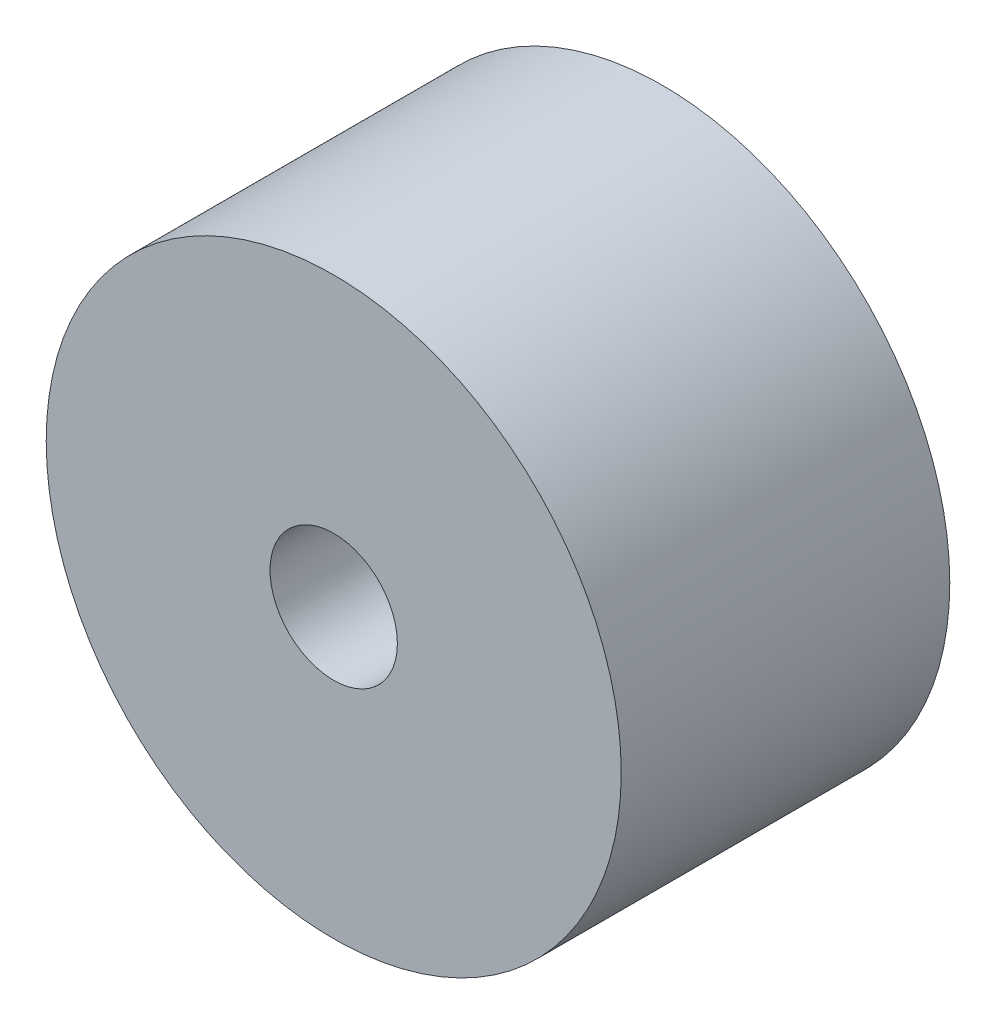
ISO-10303-21;
HEADER;
FILE_DESCRIPTION(('STEP AP214'),'2;1');
FILE_NAME('part.step','',(''),(''),'','','');
FILE_SCHEMA(('AUTOMOTIVE_DESIGN { 1 0 10303 214 1 1 1 1 }'));
ENDSEC;
DATA;
#1=APPLICATION_CONTEXT('core data for automotive mechanical design processes');
#2=APPLICATION_PROTOCOL_DEFINITION('international standard','automotive_design',2000,#1);
#3=PRODUCT_CONTEXT('',#1,'mechanical');
#4=PRODUCT('Part','Part','',(#3));
#5=PRODUCT_RELATED_PRODUCT_CATEGORY('part','',(#4));
#6=PRODUCT_DEFINITION_FORMATION('','',#4);
#7=PRODUCT_DEFINITION_CONTEXT('part definition',#1,'design');
#8=PRODUCT_DEFINITION('design','',#6,#7);
#9=PRODUCT_DEFINITION_SHAPE('','',#8);
#10=(LENGTH_UNIT() NAMED_UNIT(*) SI_UNIT(.MILLI.,.METRE.));
#11=(NAMED_UNIT(*) PLANE_ANGLE_UNIT() SI_UNIT($,.RADIAN.));
#12=(NAMED_UNIT(*) SI_UNIT($,.STERADIAN.) SOLID_ANGLE_UNIT());
#13=UNCERTAINTY_MEASURE_WITH_UNIT(LENGTH_MEASURE(1.E-05),#10,'distance_accuracy_value','');
#14=(GEOMETRIC_REPRESENTATION_CONTEXT(3) GLOBAL_UNCERTAINTY_ASSIGNED_CONTEXT((#13)) GLOBAL_UNIT_ASSIGNED_CONTEXT((#10,
#11,#12)) REPRESENTATION_CONTEXT('',''));
#15=CARTESIAN_POINT('',(0.,0.,0.));
#16=DIRECTION('',(0.,0.,1.));
#17=DIRECTION('',(1.,0.,0.));
#18=AXIS2_PLACEMENT_3D('',#15,#16,#17);
#19=CARTESIAN_POINT('',(0.,0.,8.));
#20=DIRECTION('',(0.,0.,-1.));
#21=DIRECTION('',(-1.,0.,0.));
#22=AXIS2_PLACEMENT_3D('',#19,#20,#21);
#23=CYLINDRICAL_SURFACE('',#22,7.);
#24=CARTESIAN_POINT('',(0.,0.,8.));
#25=DIRECTION('',(0.,0.,1.));
#26=DIRECTION('',(1.,0.,0.));
#27=AXIS2_PLACEMENT_3D('',#24,#25,#26);
#28=CIRCLE('',#27,7.);
#29=CARTESIAN_POINT('',(7.,0.,8.));
#30=VERTEX_POINT('',#29);
#31=EDGE_CURVE('E10',#30,#30,#28,.T.);
#32=ORIENTED_EDGE('',*,*,#31,.F.);
#33=EDGE_LOOP('',(#32));
#34=FACE_BOUND('',#33,.T.);
#35=CARTESIAN_POINT('',(0.,0.,0.));
#36=DIRECTION('',(0.,0.,1.));
#37=DIRECTION('',(1.,0.,0.));
#38=AXIS2_PLACEMENT_3D('',#35,#36,#37);
#39=CIRCLE('',#38,7.);
#40=CARTESIAN_POINT('',(7.,0.,0.));
#41=VERTEX_POINT('',#40);
#42=EDGE_CURVE('E35',#41,#41,#39,.T.);
#43=ORIENTED_EDGE('',*,*,#42,.T.);
#44=EDGE_LOOP('',(#43));
#45=FACE_BOUND('',#44,.T.);
#46=ADVANCED_FACE('F32',(#34,#45),#23,.T.);
#47=CARTESIAN_POINT('',(0.,0.,8.));
#48=DIRECTION('',(0.,0.,1.));
#49=DIRECTION('',(1.,0.,0.));
#50=AXIS2_PLACEMENT_3D('',#47,#48,#49);
#51=PLANE('',#50);
#52=CARTESIAN_POINT('',(0.,0.,8.));
#53=DIRECTION('',(0.,0.,1.));
#54=DIRECTION('',(1.,0.,0.));
#55=AXIS2_PLACEMENT_3D('',#52,#53,#54);
#56=CIRCLE('',#55,1.55);
#57=CARTESIAN_POINT('',(1.55,0.,8.));
#58=VERTEX_POINT('',#57);
#59=EDGE_CURVE('E44',#58,#58,#56,.T.);
#60=ORIENTED_EDGE('',*,*,#59,.F.);
#61=EDGE_LOOP('',(#60));
#62=FACE_BOUND('',#61,.T.);
#63=ORIENTED_EDGE('',*,*,#31,.T.);
#64=EDGE_LOOP('',(#63));
#65=FACE_BOUND('',#64,.T.);
#66=ADVANCED_FACE('F59',(#62,#65),#51,.T.);
#67=CARTESIAN_POINT('',(0.,0.,0.));
#68=DIRECTION('',(0.,0.,1.));
#69=DIRECTION('',(1.,0.,0.));
#70=AXIS2_PLACEMENT_3D('',#67,#68,#69);
#71=PLANE('',#70);
#72=ORIENTED_EDGE('',*,*,#42,.F.);
#73=EDGE_LOOP('',(#72));
#74=FACE_BOUND('',#73,.T.);
#75=ADVANCED_FACE('F55',(#74),#71,.F.);
#76=CARTESIAN_POINT('',(0.,0.,5.));
#77=DIRECTION('',(0.,0.,1.));
#78=DIRECTION('',(1.,0.,0.));
#79=AXIS2_PLACEMENT_3D('',#76,#77,#78);
#80=CYLINDRICAL_SURFACE('',#79,1.55);
#81=CARTESIAN_POINT('',(0.,0.,5.));
#82=DIRECTION('',(0.,0.,1.));
#83=DIRECTION('',(1.,0.,0.));
#84=AXIS2_PLACEMENT_3D('',#81,#82,#83);
#85=CIRCLE('',#84,1.55);
#86=CARTESIAN_POINT('',(1.55,0.,5.));
#87=VERTEX_POINT('',#86);
#88=EDGE_CURVE('E42',#87,#87,#85,.T.);
#89=ORIENTED_EDGE('',*,*,#88,.F.);
#90=EDGE_LOOP('',(#89));
#91=FACE_BOUND('',#90,.T.);
#92=ORIENTED_EDGE('',*,*,#59,.T.);
#93=EDGE_LOOP('',(#92));
#94=FACE_BOUND('',#93,.T.);
#95=ADVANCED_FACE('F52',(#91,#94),#80,.F.);
#96=CARTESIAN_POINT('',(0.,0.,5.));
#97=DIRECTION('',(0.,0.,1.));
#98=DIRECTION('',(1.,0.,0.));
#99=AXIS2_PLACEMENT_3D('',#96,#97,#98);
#100=PLANE('',#99);
#101=ORIENTED_EDGE('',*,*,#88,.T.);
#102=EDGE_LOOP('',(#101));
#103=FACE_BOUND('',#102,.T.);
#104=ADVANCED_FACE('F50',(#103),#100,.T.);
#105=CLOSED_SHELL('',(#46,#66,#75,#95,#104));
#106=MANIFOLD_SOLID_BREP('B2',#105);
#107=ADVANCED_BREP_SHAPE_REPRESENTATION('',(#18,#106),#14);
#108=SHAPE_DEFINITION_REPRESENTATION(#9,#107);
ENDSEC;
END-ISO-10303-21;
